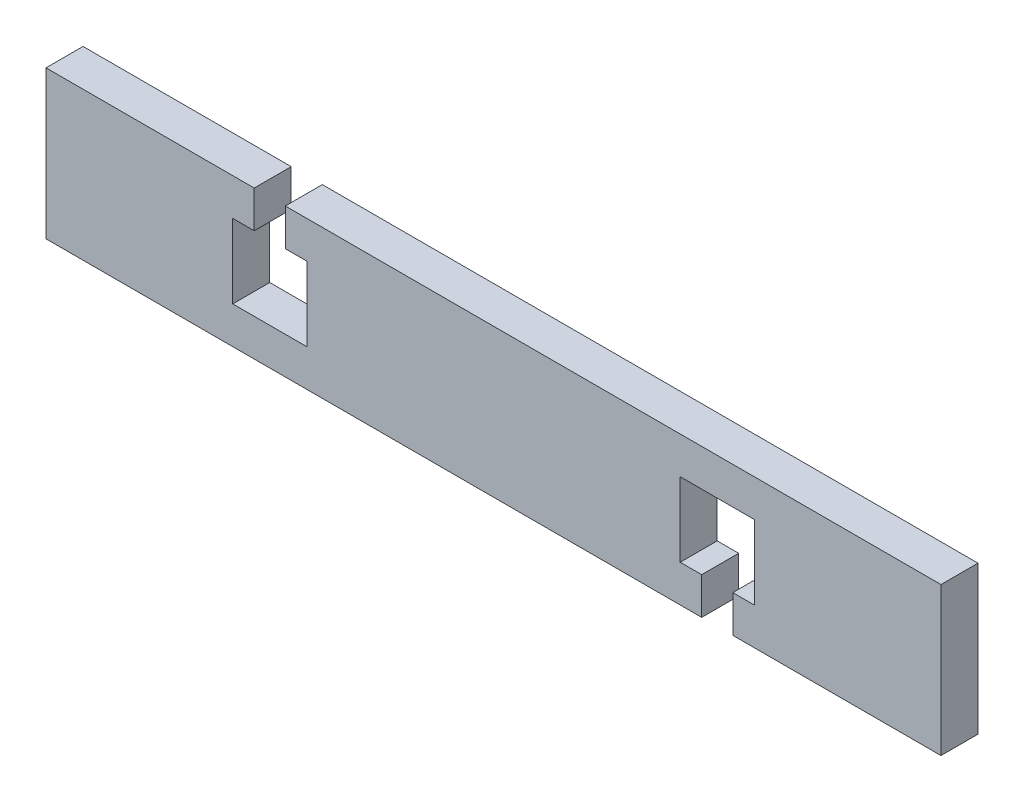
ISO-10303-21;
HEADER;
FILE_DESCRIPTION(('STEP AP214'),'2;1');
FILE_NAME('part.step','',(''),(''),'','','');
FILE_SCHEMA(('AUTOMOTIVE_DESIGN { 1 0 10303 214 1 1 1 1 }'));
ENDSEC;
DATA;
#1=APPLICATION_CONTEXT('core data for automotive mechanical design processes');
#2=APPLICATION_PROTOCOL_DEFINITION('international standard','automotive_design',2000,#1);
#3=PRODUCT_CONTEXT('',#1,'mechanical');
#4=PRODUCT('Part','Part','',(#3));
#5=PRODUCT_RELATED_PRODUCT_CATEGORY('part','',(#4));
#6=PRODUCT_DEFINITION_FORMATION('','',#4);
#7=PRODUCT_DEFINITION_CONTEXT('part definition',#1,'design');
#8=PRODUCT_DEFINITION('design','',#6,#7);
#9=PRODUCT_DEFINITION_SHAPE('','',#8);
#10=(LENGTH_UNIT() NAMED_UNIT(*) SI_UNIT(.MILLI.,.METRE.));
#11=(NAMED_UNIT(*) PLANE_ANGLE_UNIT() SI_UNIT($,.RADIAN.));
#12=(NAMED_UNIT(*) SI_UNIT($,.STERADIAN.) SOLID_ANGLE_UNIT());
#13=UNCERTAINTY_MEASURE_WITH_UNIT(LENGTH_MEASURE(1.E-05),#10,'distance_accuracy_value','');
#14=(GEOMETRIC_REPRESENTATION_CONTEXT(3) GLOBAL_UNCERTAINTY_ASSIGNED_CONTEXT((#13)) GLOBAL_UNIT_ASSIGNED_CONTEXT((#10,
#11,#12)) REPRESENTATION_CONTEXT('',''));
#15=CARTESIAN_POINT('',(0.,0.,0.));
#16=DIRECTION('',(0.,0.,1.));
#17=DIRECTION('',(1.,0.,0.));
#18=AXIS2_PLACEMENT_3D('',#15,#16,#17);
#19=CARTESIAN_POINT('',(-32.3125,10.,5.));
#20=DIRECTION('',(0.,-1.,0.));
#21=DIRECTION('',(1.,0.,0.));
#22=AXIS2_PLACEMENT_3D('',#19,#20,#21);
#23=PLANE('',#22);
#24=DIRECTION('',(-1.,0.,0.));
#25=VECTOR('',#24,1.);
#26=CARTESIAN_POINT('',(-32.3125,10.,0.));
#27=LINE('',#26,#25);
#28=CARTESIAN_POINT('',(-32.3125,10.,0.));
#29=VERTEX_POINT('',#28);
#30=CARTESIAN_POINT('',(-60.425,9.99999999999999,0.));
#31=VERTEX_POINT('',#30);
#32=EDGE_CURVE('E205',#29,#31,#27,.T.);
#33=ORIENTED_EDGE('',*,*,#32,.T.);
#34=DIRECTION('',(0.,0.,-1.));
#35=VECTOR('',#34,1.);
#36=CARTESIAN_POINT('',(-60.425,9.99999999999999,5.));
#37=LINE('',#36,#35);
#38=CARTESIAN_POINT('',(-60.425,9.99999999999999,5.));
#39=VERTEX_POINT('',#38);
#40=EDGE_CURVE('E11',#39,#31,#37,.T.);
#41=ORIENTED_EDGE('',*,*,#40,.F.);
#42=DIRECTION('',(-1.,0.,0.));
#43=VECTOR('',#42,1.);
#44=CARTESIAN_POINT('',(-32.3125,10.,5.));
#45=LINE('',#44,#43);
#46=CARTESIAN_POINT('',(-32.3125,10.,5.));
#47=VERTEX_POINT('',#46);
#48=EDGE_CURVE('E244',#47,#39,#45,.T.);
#49=ORIENTED_EDGE('',*,*,#48,.F.);
#50=DIRECTION('',(0.,0.,-1.));
#51=VECTOR('',#50,1.);
#52=CARTESIAN_POINT('',(-32.3125,10.,5.));
#53=LINE('',#52,#51);
#54=EDGE_CURVE('E201',#47,#29,#53,.T.);
#55=ORIENTED_EDGE('',*,*,#54,.T.);
#56=EDGE_LOOP('',(#33,#41,#49,#55));
#57=FACE_BOUND('',#56,.T.);
#58=ADVANCED_FACE('F37',(#57),#23,.F.);
#59=CARTESIAN_POINT('',(-60.425,-10.,5.));
#60=DIRECTION('',(1.,0.,0.));
#61=DIRECTION('',(0.,0.,-1.));
#62=AXIS2_PLACEMENT_3D('',#59,#60,#61);
#63=PLANE('',#62);
#64=DIRECTION('',(0.,-1.,0.));
#65=VECTOR('',#64,1.);
#66=CARTESIAN_POINT('',(-60.425,-10.,0.));
#67=LINE('',#66,#65);
#68=CARTESIAN_POINT('',(-60.425,-10.,0.));
#69=VERTEX_POINT('',#68);
#70=EDGE_CURVE('E208',#31,#69,#67,.T.);
#71=ORIENTED_EDGE('',*,*,#70,.T.);
#72=DIRECTION('',(0.,0.,-1.));
#73=VECTOR('',#72,1.);
#74=CARTESIAN_POINT('',(-60.425,-10.,5.));
#75=LINE('',#74,#73);
#76=CARTESIAN_POINT('',(-60.425,-10.,5.));
#77=VERTEX_POINT('',#76);
#78=EDGE_CURVE('E45',#77,#69,#75,.T.);
#79=ORIENTED_EDGE('',*,*,#78,.F.);
#80=DIRECTION('',(0.,-1.,0.));
#81=VECTOR('',#80,1.);
#82=CARTESIAN_POINT('',(-60.425,-10.,5.));
#83=LINE('',#82,#81);
#84=EDGE_CURVE('E132',#39,#77,#83,.T.);
#85=ORIENTED_EDGE('',*,*,#84,.F.);
#86=ORIENTED_EDGE('',*,*,#40,.T.);
#87=EDGE_LOOP('',(#71,#79,#85,#86));
#88=FACE_BOUND('',#87,.T.);
#89=ADVANCED_FACE('F361',(#88),#63,.F.);
#90=CARTESIAN_POINT('',(28.1125,-9.99999999999999,5.));
#91=DIRECTION('',(0.,1.,0.));
#92=DIRECTION('',(-1.,0.,0.));
#93=AXIS2_PLACEMENT_3D('',#90,#91,#92);
#94=PLANE('',#93);
#95=DIRECTION('',(1.,0.,0.));
#96=VECTOR('',#95,1.);
#97=CARTESIAN_POINT('',(28.1125,-9.99999999999999,0.));
#98=LINE('',#97,#96);
#99=CARTESIAN_POINT('',(28.1125,-9.99999999999999,0.));
#100=VERTEX_POINT('',#99);
#101=EDGE_CURVE('E210',#69,#100,#98,.T.);
#102=ORIENTED_EDGE('',*,*,#101,.T.);
#103=DIRECTION('',(0.,0.,-1.));
#104=VECTOR('',#103,1.);
#105=CARTESIAN_POINT('',(28.1125,-9.99999999999999,5.));
#106=LINE('',#105,#104);
#107=CARTESIAN_POINT('',(28.1125,-9.99999999999999,5.));
#108=VERTEX_POINT('',#107);
#109=EDGE_CURVE('E287',#108,#100,#106,.T.);
#110=ORIENTED_EDGE('',*,*,#109,.F.);
#111=DIRECTION('',(1.,0.,0.));
#112=VECTOR('',#111,1.);
#113=CARTESIAN_POINT('',(28.1125,-9.99999999999999,5.));
#114=LINE('',#113,#112);
#115=EDGE_CURVE('E295',#77,#108,#114,.T.);
#116=ORIENTED_EDGE('',*,*,#115,.F.);
#117=ORIENTED_EDGE('',*,*,#78,.T.);
#118=EDGE_LOOP('',(#102,#110,#116,#117));
#119=FACE_BOUND('',#118,.T.);
#120=ADVANCED_FACE('F293',(#119),#94,.F.);
#121=CARTESIAN_POINT('',(28.1125,-9.99999999999999,5.));
#122=DIRECTION('',(-1.,0.,0.));
#123=DIRECTION('',(0.,-1.,0.));
#124=AXIS2_PLACEMENT_3D('',#121,#122,#123);
#125=PLANE('',#124);
#126=DIRECTION('',(0.,1.,0.));
#127=VECTOR('',#126,1.);
#128=CARTESIAN_POINT('',(28.1125,-9.99999999999999,0.));
#129=LINE('',#128,#127);
#130=CARTESIAN_POINT('',(28.1125,-4.99999999999999,0.));
#131=VERTEX_POINT('',#130);
#132=EDGE_CURVE('E212',#100,#131,#129,.T.);
#133=ORIENTED_EDGE('',*,*,#132,.T.);
#134=DIRECTION('',(0.,0.,-1.));
#135=VECTOR('',#134,1.);
#136=CARTESIAN_POINT('',(28.1125,-4.99999999999999,5.));
#137=LINE('',#136,#135);
#138=CARTESIAN_POINT('',(28.1125,-4.99999999999999,5.));
#139=VERTEX_POINT('',#138);
#140=EDGE_CURVE('E284',#139,#131,#137,.T.);
#141=ORIENTED_EDGE('',*,*,#140,.F.);
#142=DIRECTION('',(0.,1.,0.));
#143=VECTOR('',#142,1.);
#144=CARTESIAN_POINT('',(28.1125,-9.99999999999999,5.));
#145=LINE('',#144,#143);
#146=EDGE_CURVE('E313',#108,#139,#145,.T.);
#147=ORIENTED_EDGE('',*,*,#146,.F.);
#148=ORIENTED_EDGE('',*,*,#109,.T.);
#149=EDGE_LOOP('',(#133,#141,#147,#148));
#150=FACE_BOUND('',#149,.T.);
#151=ADVANCED_FACE('F304',(#150),#125,.F.);
#152=CARTESIAN_POINT('',(28.1125,-4.99999999999999,5.));
#153=DIRECTION('',(0.,-1.,0.));
#154=DIRECTION('',(0.,0.,-1.));
#155=AXIS2_PLACEMENT_3D('',#152,#153,#154);
#156=PLANE('',#155);
#157=DIRECTION('',(-1.,0.,0.));
#158=VECTOR('',#157,1.);
#159=CARTESIAN_POINT('',(28.1125,-4.99999999999999,0.));
#160=LINE('',#159,#158);
#161=CARTESIAN_POINT('',(25.2125,-4.99999999999999,0.));
#162=VERTEX_POINT('',#161);
#163=EDGE_CURVE('E214',#131,#162,#160,.T.);
#164=ORIENTED_EDGE('',*,*,#163,.T.);
#165=DIRECTION('',(0.,0.,-1.));
#166=VECTOR('',#165,1.);
#167=CARTESIAN_POINT('',(25.2125,-4.99999999999999,5.));
#168=LINE('',#167,#166);
#169=CARTESIAN_POINT('',(25.2125,-4.99999999999999,5.));
#170=VERTEX_POINT('',#169);
#171=EDGE_CURVE('E281',#170,#162,#168,.T.);
#172=ORIENTED_EDGE('',*,*,#171,.F.);
#173=DIRECTION('',(-1.,0.,0.));
#174=VECTOR('',#173,1.);
#175=CARTESIAN_POINT('',(28.1125,-4.99999999999999,5.));
#176=LINE('',#175,#174);
#177=EDGE_CURVE('E310',#139,#170,#176,.T.);
#178=ORIENTED_EDGE('',*,*,#177,.F.);
#179=ORIENTED_EDGE('',*,*,#140,.T.);
#180=EDGE_LOOP('',(#164,#172,#178,#179));
#181=FACE_BOUND('',#180,.T.);
#182=ADVANCED_FACE('F308',(#181),#156,.F.);
#183=CARTESIAN_POINT('',(25.2125,-4.99999999999999,5.));
#184=DIRECTION('',(-1.,0.,0.));
#185=DIRECTION('',(0.,-1.,0.));
#186=AXIS2_PLACEMENT_3D('',#183,#184,#185);
#187=PLANE('',#186);
#188=DIRECTION('',(0.,1.,0.));
#189=VECTOR('',#188,1.);
#190=CARTESIAN_POINT('',(25.2125,-4.99999999999999,0.));
#191=LINE('',#190,#189);
#192=CARTESIAN_POINT('',(25.2125,5.,0.));
#193=VERTEX_POINT('',#192);
#194=EDGE_CURVE('E216',#162,#193,#191,.T.);
#195=ORIENTED_EDGE('',*,*,#194,.T.);
#196=DIRECTION('',(0.,0.,-1.));
#197=VECTOR('',#196,1.);
#198=CARTESIAN_POINT('',(25.2125,5.,5.));
#199=LINE('',#198,#197);
#200=CARTESIAN_POINT('',(25.2125,5.,5.));
#201=VERTEX_POINT('',#200);
#202=EDGE_CURVE('E278',#201,#193,#199,.T.);
#203=ORIENTED_EDGE('',*,*,#202,.F.);
#204=DIRECTION('',(0.,1.,0.));
#205=VECTOR('',#204,1.);
#206=CARTESIAN_POINT('',(25.2125,-4.99999999999999,5.));
#207=LINE('',#206,#205);
#208=EDGE_CURVE('E312',#170,#201,#207,.T.);
#209=ORIENTED_EDGE('',*,*,#208,.F.);
#210=ORIENTED_EDGE('',*,*,#171,.T.);
#211=EDGE_LOOP('',(#195,#203,#209,#210));
#212=FACE_BOUND('',#211,.T.);
#213=ADVANCED_FACE('F374',(#212),#187,.F.);
#214=CARTESIAN_POINT('',(25.2125,5.,5.));
#215=DIRECTION('',(0.,1.,0.));
#216=DIRECTION('',(-1.,0.,0.));
#217=AXIS2_PLACEMENT_3D('',#214,#215,#216);
#218=PLANE('',#217);
#219=DIRECTION('',(1.,0.,0.));
#220=VECTOR('',#219,1.);
#221=CARTESIAN_POINT('',(25.2125,5.,0.));
#222=LINE('',#221,#220);
#223=CARTESIAN_POINT('',(35.2125000000001,5.00000000000001,0.));
#224=VERTEX_POINT('',#223);
#225=EDGE_CURVE('E218',#193,#224,#222,.T.);
#226=ORIENTED_EDGE('',*,*,#225,.T.);
#227=DIRECTION('',(0.,0.,-1.));
#228=VECTOR('',#227,1.);
#229=CARTESIAN_POINT('',(35.2125000000001,5.00000000000001,5.));
#230=LINE('',#229,#228);
#231=CARTESIAN_POINT('',(35.2125000000001,5.00000000000001,5.));
#232=VERTEX_POINT('',#231);
#233=EDGE_CURVE('E275',#232,#224,#230,.T.);
#234=ORIENTED_EDGE('',*,*,#233,.F.);
#235=DIRECTION('',(1.,0.,0.));
#236=VECTOR('',#235,1.);
#237=CARTESIAN_POINT('',(25.2125,5.,5.));
#238=LINE('',#237,#236);
#239=EDGE_CURVE('E315',#201,#232,#238,.T.);
#240=ORIENTED_EDGE('',*,*,#239,.F.);
#241=ORIENTED_EDGE('',*,*,#202,.T.);
#242=EDGE_LOOP('',(#226,#234,#240,#241));
#243=FACE_BOUND('',#242,.T.);
#244=ADVANCED_FACE('F377',(#243),#218,.F.);
#245=CARTESIAN_POINT('',(35.2125000000001,-4.99999999999999,5.));
#246=DIRECTION('',(1.,0.,0.));
#247=DIRECTION('',(0.,0.,-1.));
#248=AXIS2_PLACEMENT_3D('',#245,#246,#247);
#249=PLANE('',#248);
#250=DIRECTION('',(0.,-1.,0.));
#251=VECTOR('',#250,1.);
#252=CARTESIAN_POINT('',(35.2125000000001,-4.99999999999999,0.));
#253=LINE('',#252,#251);
#254=CARTESIAN_POINT('',(35.2125000000001,-4.99999999999999,0.));
#255=VERTEX_POINT('',#254);
#256=EDGE_CURVE('E220',#224,#255,#253,.T.);
#257=ORIENTED_EDGE('',*,*,#256,.T.);
#258=DIRECTION('',(0.,0.,-1.));
#259=VECTOR('',#258,1.);
#260=CARTESIAN_POINT('',(35.2125000000001,-4.99999999999999,5.));
#261=LINE('',#260,#259);
#262=CARTESIAN_POINT('',(35.2125000000001,-4.99999999999999,5.));
#263=VERTEX_POINT('',#262);
#264=EDGE_CURVE('E272',#263,#255,#261,.T.);
#265=ORIENTED_EDGE('',*,*,#264,.F.);
#266=DIRECTION('',(0.,-1.,0.));
#267=VECTOR('',#266,1.);
#268=CARTESIAN_POINT('',(35.2125000000001,-4.99999999999999,5.));
#269=LINE('',#268,#267);
#270=EDGE_CURVE('E321',#232,#263,#269,.T.);
#271=ORIENTED_EDGE('',*,*,#270,.F.);
#272=ORIENTED_EDGE('',*,*,#233,.T.);
#273=EDGE_LOOP('',(#257,#265,#271,#272));
#274=FACE_BOUND('',#273,.T.);
#275=ADVANCED_FACE('F381',(#274),#249,.F.);
#276=CARTESIAN_POINT('',(32.3125000000001,-4.99999999999999,5.));
#277=DIRECTION('',(0.,-1.,0.));
#278=DIRECTION('',(1.,0.,0.));
#279=AXIS2_PLACEMENT_3D('',#276,#277,#278);
#280=PLANE('',#279);
#281=DIRECTION('',(-1.,0.,0.));
#282=VECTOR('',#281,1.);
#283=CARTESIAN_POINT('',(32.3125000000001,-4.99999999999999,0.));
#284=LINE('',#283,#282);
#285=CARTESIAN_POINT('',(32.3125000000001,-4.99999999999999,0.));
#286=VERTEX_POINT('',#285);
#287=EDGE_CURVE('E222',#255,#286,#284,.T.);
#288=ORIENTED_EDGE('',*,*,#287,.T.);
#289=DIRECTION('',(0.,0.,-1.));
#290=VECTOR('',#289,1.);
#291=CARTESIAN_POINT('',(32.3125000000001,-4.99999999999999,5.));
#292=LINE('',#291,#290);
#293=CARTESIAN_POINT('',(32.3125000000001,-4.99999999999999,5.));
#294=VERTEX_POINT('',#293);
#295=EDGE_CURVE('E269',#294,#286,#292,.T.);
#296=ORIENTED_EDGE('',*,*,#295,.F.);
#297=DIRECTION('',(-1.,0.,0.));
#298=VECTOR('',#297,1.);
#299=CARTESIAN_POINT('',(32.3125000000001,-4.99999999999999,5.));
#300=LINE('',#299,#298);
#301=EDGE_CURVE('E323',#263,#294,#300,.T.);
#302=ORIENTED_EDGE('',*,*,#301,.F.);
#303=ORIENTED_EDGE('',*,*,#264,.T.);
#304=EDGE_LOOP('',(#288,#296,#302,#303));
#305=FACE_BOUND('',#304,.T.);
#306=ADVANCED_FACE('F385',(#305),#280,.F.);
#307=CARTESIAN_POINT('',(32.3125000000001,-9.99999999999999,5.));
#308=DIRECTION('',(1.,0.,0.));
#309=DIRECTION('',(0.,1.,0.));
#310=AXIS2_PLACEMENT_3D('',#307,#308,#309);
#311=PLANE('',#310);
#312=DIRECTION('',(0.,-1.,0.));
#313=VECTOR('',#312,1.);
#314=CARTESIAN_POINT('',(32.3125000000001,-9.99999999999999,0.));
#315=LINE('',#314,#313);
#316=CARTESIAN_POINT('',(32.3125000000001,-9.99999999999999,0.));
#317=VERTEX_POINT('',#316);
#318=EDGE_CURVE('E224',#286,#317,#315,.T.);
#319=ORIENTED_EDGE('',*,*,#318,.T.);
#320=DIRECTION('',(0.,0.,-1.));
#321=VECTOR('',#320,1.);
#322=CARTESIAN_POINT('',(32.3125000000001,-9.99999999999999,5.));
#323=LINE('',#322,#321);
#324=CARTESIAN_POINT('',(32.3125000000001,-9.99999999999999,5.));
#325=VERTEX_POINT('',#324);
#326=EDGE_CURVE('E266',#325,#317,#323,.T.);
#327=ORIENTED_EDGE('',*,*,#326,.F.);
#328=DIRECTION('',(0.,-1.,0.));
#329=VECTOR('',#328,1.);
#330=CARTESIAN_POINT('',(32.3125000000001,-9.99999999999999,5.));
#331=LINE('',#330,#329);
#332=EDGE_CURVE('E325',#294,#325,#331,.T.);
#333=ORIENTED_EDGE('',*,*,#332,.F.);
#334=ORIENTED_EDGE('',*,*,#295,.T.);
#335=EDGE_LOOP('',(#319,#327,#333,#334));
#336=FACE_BOUND('',#335,.T.);
#337=ADVANCED_FACE('F389',(#336),#311,.F.);
#338=CARTESIAN_POINT('',(60.425,-9.99999999999999,5.));
#339=DIRECTION('',(0.,1.,0.));
#340=DIRECTION('',(0.,0.,1.));
#341=AXIS2_PLACEMENT_3D('',#338,#339,#340);
#342=PLANE('',#341);
#343=DIRECTION('',(1.,0.,0.));
#344=VECTOR('',#343,1.);
#345=CARTESIAN_POINT('',(60.425,-9.99999999999999,0.));
#346=LINE('',#345,#344);
#347=CARTESIAN_POINT('',(60.425,-9.99999999999999,0.));
#348=VERTEX_POINT('',#347);
#349=EDGE_CURVE('E226',#317,#348,#346,.T.);
#350=ORIENTED_EDGE('',*,*,#349,.T.);
#351=DIRECTION('',(0.,0.,-1.));
#352=VECTOR('',#351,1.);
#353=CARTESIAN_POINT('',(60.425,-9.99999999999999,5.));
#354=LINE('',#353,#352);
#355=CARTESIAN_POINT('',(60.425,-9.99999999999999,5.));
#356=VERTEX_POINT('',#355);
#357=EDGE_CURVE('E263',#356,#348,#354,.T.);
#358=ORIENTED_EDGE('',*,*,#357,.F.);
#359=DIRECTION('',(1.,0.,0.));
#360=VECTOR('',#359,1.);
#361=CARTESIAN_POINT('',(60.425,-9.99999999999999,5.));
#362=LINE('',#361,#360);
#363=EDGE_CURVE('E327',#325,#356,#362,.T.);
#364=ORIENTED_EDGE('',*,*,#363,.F.);
#365=ORIENTED_EDGE('',*,*,#326,.T.);
#366=EDGE_LOOP('',(#350,#358,#364,#365));
#367=FACE_BOUND('',#366,.T.);
#368=ADVANCED_FACE('F393',(#367),#342,.F.);
#369=CARTESIAN_POINT('',(60.425,-9.99999999999999,5.));
#370=DIRECTION('',(-1.,0.,0.));
#371=DIRECTION('',(0.,0.,1.));
#372=AXIS2_PLACEMENT_3D('',#369,#370,#371);
#373=PLANE('',#372);
#374=DIRECTION('',(0.,1.,0.));
#375=VECTOR('',#374,1.);
#376=CARTESIAN_POINT('',(60.425,-9.99999999999999,0.));
#377=LINE('',#376,#375);
#378=CARTESIAN_POINT('',(60.425,10.,0.));
#379=VERTEX_POINT('',#378);
#380=EDGE_CURVE('E228',#348,#379,#377,.T.);
#381=ORIENTED_EDGE('',*,*,#380,.T.);
#382=DIRECTION('',(0.,0.,-1.));
#383=VECTOR('',#382,1.);
#384=CARTESIAN_POINT('',(60.425,10.,5.));
#385=LINE('',#384,#383);
#386=CARTESIAN_POINT('',(60.425,10.,5.));
#387=VERTEX_POINT('',#386);
#388=EDGE_CURVE('E260',#387,#379,#385,.T.);
#389=ORIENTED_EDGE('',*,*,#388,.F.);
#390=DIRECTION('',(0.,1.,0.));
#391=VECTOR('',#390,1.);
#392=CARTESIAN_POINT('',(60.425,-9.99999999999999,5.));
#393=LINE('',#392,#391);
#394=EDGE_CURVE('E329',#356,#387,#393,.T.);
#395=ORIENTED_EDGE('',*,*,#394,.F.);
#396=ORIENTED_EDGE('',*,*,#357,.T.);
#397=EDGE_LOOP('',(#381,#389,#395,#396));
#398=FACE_BOUND('',#397,.T.);
#399=ADVANCED_FACE('F397',(#398),#373,.F.);
#400=CARTESIAN_POINT('',(60.425,10.,5.));
#401=DIRECTION('',(0.,-1.,0.));
#402=DIRECTION('',(1.,0.,0.));
#403=AXIS2_PLACEMENT_3D('',#400,#401,#402);
#404=PLANE('',#403);
#405=DIRECTION('',(-1.,0.,0.));
#406=VECTOR('',#405,1.);
#407=CARTESIAN_POINT('',(60.425,10.,0.));
#408=LINE('',#407,#406);
#409=CARTESIAN_POINT('',(-28.1125,9.99999999999997,0.));
#410=VERTEX_POINT('',#409);
#411=EDGE_CURVE('E230',#379,#410,#408,.T.);
#412=ORIENTED_EDGE('',*,*,#411,.T.);
#413=DIRECTION('',(0.,0.,-1.));
#414=VECTOR('',#413,1.);
#415=CARTESIAN_POINT('',(-28.1125,9.99999999999997,5.));
#416=LINE('',#415,#414);
#417=CARTESIAN_POINT('',(-28.1125,9.99999999999997,5.));
#418=VERTEX_POINT('',#417);
#419=EDGE_CURVE('E257',#418,#410,#416,.T.);
#420=ORIENTED_EDGE('',*,*,#419,.F.);
#421=DIRECTION('',(-1.,0.,0.));
#422=VECTOR('',#421,1.);
#423=CARTESIAN_POINT('',(60.425,10.,5.));
#424=LINE('',#423,#422);
#425=EDGE_CURVE('E331',#387,#418,#424,.T.);
#426=ORIENTED_EDGE('',*,*,#425,.F.);
#427=ORIENTED_EDGE('',*,*,#388,.T.);
#428=EDGE_LOOP('',(#412,#420,#426,#427));
#429=FACE_BOUND('',#428,.T.);
#430=ADVANCED_FACE('F401',(#429),#404,.F.);
#431=CARTESIAN_POINT('',(-28.1125,9.99999999999997,5.));
#432=DIRECTION('',(1.,0.,0.));
#433=DIRECTION('',(0.,1.,0.));
#434=AXIS2_PLACEMENT_3D('',#431,#432,#433);
#435=PLANE('',#434);
#436=DIRECTION('',(0.,-1.,0.));
#437=VECTOR('',#436,1.);
#438=CARTESIAN_POINT('',(-28.1125,9.99999999999997,0.));
#439=LINE('',#438,#437);
#440=CARTESIAN_POINT('',(-28.1125,4.99999999999997,0.));
#441=VERTEX_POINT('',#440);
#442=EDGE_CURVE('E232',#410,#441,#439,.T.);
#443=ORIENTED_EDGE('',*,*,#442,.T.);
#444=DIRECTION('',(0.,0.,-1.));
#445=VECTOR('',#444,1.);
#446=CARTESIAN_POINT('',(-28.1125,4.99999999999997,5.));
#447=LINE('',#446,#445);
#448=CARTESIAN_POINT('',(-28.1125,4.99999999999997,5.));
#449=VERTEX_POINT('',#448);
#450=EDGE_CURVE('E254',#449,#441,#447,.T.);
#451=ORIENTED_EDGE('',*,*,#450,.F.);
#452=DIRECTION('',(0.,-1.,0.));
#453=VECTOR('',#452,1.);
#454=CARTESIAN_POINT('',(-28.1125,9.99999999999997,5.));
#455=LINE('',#454,#453);
#456=EDGE_CURVE('E333',#418,#449,#455,.T.);
#457=ORIENTED_EDGE('',*,*,#456,.F.);
#458=ORIENTED_EDGE('',*,*,#419,.T.);
#459=EDGE_LOOP('',(#443,#451,#457,#458));
#460=FACE_BOUND('',#459,.T.);
#461=ADVANCED_FACE('F405',(#460),#435,.F.);
#462=CARTESIAN_POINT('',(-28.1125,4.99999999999997,5.));
#463=DIRECTION('',(0.,1.,0.));
#464=DIRECTION('',(-1.,0.,0.));
#465=AXIS2_PLACEMENT_3D('',#462,#463,#464);
#466=PLANE('',#465);
#467=DIRECTION('',(1.,0.,0.));
#468=VECTOR('',#467,1.);
#469=CARTESIAN_POINT('',(-28.1125,4.99999999999997,0.));
#470=LINE('',#469,#468);
#471=CARTESIAN_POINT('',(-25.2125,4.99999999999994,0.));
#472=VERTEX_POINT('',#471);
#473=EDGE_CURVE('E234',#441,#472,#470,.T.);
#474=ORIENTED_EDGE('',*,*,#473,.T.);
#475=DIRECTION('',(0.,0.,-1.));
#476=VECTOR('',#475,1.);
#477=CARTESIAN_POINT('',(-25.2125,4.99999999999994,5.));
#478=LINE('',#477,#476);
#479=CARTESIAN_POINT('',(-25.2125,4.99999999999994,5.));
#480=VERTEX_POINT('',#479);
#481=EDGE_CURVE('E251',#480,#472,#478,.T.);
#482=ORIENTED_EDGE('',*,*,#481,.F.);
#483=DIRECTION('',(1.,0.,0.));
#484=VECTOR('',#483,1.);
#485=CARTESIAN_POINT('',(-28.1125,4.99999999999997,5.));
#486=LINE('',#485,#484);
#487=EDGE_CURVE('E335',#449,#480,#486,.T.);
#488=ORIENTED_EDGE('',*,*,#487,.F.);
#489=ORIENTED_EDGE('',*,*,#450,.T.);
#490=EDGE_LOOP('',(#474,#482,#488,#489));
#491=FACE_BOUND('',#490,.T.);
#492=ADVANCED_FACE('F409',(#491),#466,.F.);
#493=CARTESIAN_POINT('',(-25.2125,4.99999999999994,5.));
#494=DIRECTION('',(1.,0.,0.));
#495=DIRECTION('',(0.,1.,0.));
#496=AXIS2_PLACEMENT_3D('',#493,#494,#495);
#497=PLANE('',#496);
#498=DIRECTION('',(0.,-1.,0.));
#499=VECTOR('',#498,1.);
#500=CARTESIAN_POINT('',(-25.2125,4.99999999999994,0.));
#501=LINE('',#500,#499);
#502=CARTESIAN_POINT('',(-25.2125000000001,-5.00000000000006,0.));
#503=VERTEX_POINT('',#502);
#504=EDGE_CURVE('E236',#472,#503,#501,.T.);
#505=ORIENTED_EDGE('',*,*,#504,.T.);
#506=DIRECTION('',(0.,0.,-1.));
#507=VECTOR('',#506,1.);
#508=CARTESIAN_POINT('',(-25.2125000000001,-5.00000000000006,5.));
#509=LINE('',#508,#507);
#510=CARTESIAN_POINT('',(-25.2125000000001,-5.00000000000006,5.));
#511=VERTEX_POINT('',#510);
#512=EDGE_CURVE('E248',#511,#503,#509,.T.);
#513=ORIENTED_EDGE('',*,*,#512,.F.);
#514=DIRECTION('',(0.,-1.,0.));
#515=VECTOR('',#514,1.);
#516=CARTESIAN_POINT('',(-25.2125,4.99999999999994,5.));
#517=LINE('',#516,#515);
#518=EDGE_CURVE('E337',#480,#511,#517,.T.);
#519=ORIENTED_EDGE('',*,*,#518,.F.);
#520=ORIENTED_EDGE('',*,*,#481,.T.);
#521=EDGE_LOOP('',(#505,#513,#519,#520));
#522=FACE_BOUND('',#521,.T.);
#523=ADVANCED_FACE('F343',(#522),#497,.F.);
#524=CARTESIAN_POINT('',(-35.2125,-5.,5.));
#525=DIRECTION('',(0.,-1.,0.));
#526=DIRECTION('',(1.,0.,0.));
#527=AXIS2_PLACEMENT_3D('',#524,#525,#526);
#528=PLANE('',#527);
#529=DIRECTION('',(-1.,0.,0.));
#530=VECTOR('',#529,1.);
#531=CARTESIAN_POINT('',(-35.2125,-5.,0.));
#532=LINE('',#531,#530);
#533=CARTESIAN_POINT('',(-35.2125,-5.,0.));
#534=VERTEX_POINT('',#533);
#535=EDGE_CURVE('E239',#503,#534,#532,.T.);
#536=ORIENTED_EDGE('',*,*,#535,.T.);
#537=DIRECTION('',(0.,0.,-1.));
#538=VECTOR('',#537,1.);
#539=CARTESIAN_POINT('',(-35.2125,-5.,5.));
#540=LINE('',#539,#538);
#541=CARTESIAN_POINT('',(-35.2125,-5.,5.));
#542=VERTEX_POINT('',#541);
#543=EDGE_CURVE('E196',#542,#534,#540,.T.);
#544=ORIENTED_EDGE('',*,*,#543,.F.);
#545=DIRECTION('',(-1.,0.,0.));
#546=VECTOR('',#545,1.);
#547=CARTESIAN_POINT('',(-25.2125000000001,-5.00000000000006,5.));
#548=LINE('',#547,#546);
#549=EDGE_CURVE('E187',#511,#542,#548,.T.);
#550=ORIENTED_EDGE('',*,*,#549,.F.);
#551=ORIENTED_EDGE('',*,*,#512,.T.);
#552=EDGE_LOOP('',(#536,#544,#550,#551));
#553=FACE_BOUND('',#552,.T.);
#554=ADVANCED_FACE('F346',(#553),#528,.F.);
#555=CARTESIAN_POINT('',(-35.2125,5.,5.));
#556=DIRECTION('',(-1.,0.,0.));
#557=DIRECTION('',(0.,0.,1.));
#558=AXIS2_PLACEMENT_3D('',#555,#556,#557);
#559=PLANE('',#558);
#560=DIRECTION('',(0.,1.,0.));
#561=VECTOR('',#560,1.);
#562=CARTESIAN_POINT('',(-35.2125,5.,0.));
#563=LINE('',#562,#561);
#564=CARTESIAN_POINT('',(-35.2125,5.,0.));
#565=VERTEX_POINT('',#564);
#566=EDGE_CURVE('E195',#534,#565,#563,.T.);
#567=ORIENTED_EDGE('',*,*,#566,.T.);
#568=DIRECTION('',(0.,0.,-1.));
#569=VECTOR('',#568,1.);
#570=CARTESIAN_POINT('',(-35.2125,5.,5.));
#571=LINE('',#570,#569);
#572=CARTESIAN_POINT('',(-35.2125,5.,5.));
#573=VERTEX_POINT('',#572);
#574=EDGE_CURVE('E192',#573,#565,#571,.T.);
#575=ORIENTED_EDGE('',*,*,#574,.F.);
#576=DIRECTION('',(0.,1.,0.));
#577=VECTOR('',#576,1.);
#578=CARTESIAN_POINT('',(-35.2125,5.,5.));
#579=LINE('',#578,#577);
#580=EDGE_CURVE('E181',#542,#573,#579,.T.);
#581=ORIENTED_EDGE('',*,*,#580,.F.);
#582=ORIENTED_EDGE('',*,*,#543,.T.);
#583=EDGE_LOOP('',(#567,#575,#581,#582));
#584=FACE_BOUND('',#583,.T.);
#585=ADVANCED_FACE('F193',(#584),#559,.F.);
#586=CARTESIAN_POINT('',(-32.3125,5.,5.));
#587=DIRECTION('',(0.,1.,0.));
#588=DIRECTION('',(0.,0.,1.));
#589=AXIS2_PLACEMENT_3D('',#586,#587,#588);
#590=PLANE('',#589);
#591=DIRECTION('',(1.,0.,0.));
#592=VECTOR('',#591,1.);
#593=CARTESIAN_POINT('',(-32.3125,5.,0.));
#594=LINE('',#593,#592);
#595=CARTESIAN_POINT('',(-32.3125,5.,0.));
#596=VERTEX_POINT('',#595);
#597=EDGE_CURVE('E118',#565,#596,#594,.T.);
#598=ORIENTED_EDGE('',*,*,#597,.T.);
#599=DIRECTION('',(0.,0.,-1.));
#600=VECTOR('',#599,1.);
#601=CARTESIAN_POINT('',(-32.3125,5.,5.));
#602=LINE('',#601,#600);
#603=CARTESIAN_POINT('',(-32.3125,5.,5.));
#604=VERTEX_POINT('',#603);
#605=EDGE_CURVE('E197',#604,#596,#602,.T.);
#606=ORIENTED_EDGE('',*,*,#605,.F.);
#607=DIRECTION('',(1.,0.,0.));
#608=VECTOR('',#607,1.);
#609=CARTESIAN_POINT('',(-32.3125,5.,5.));
#610=LINE('',#609,#608);
#611=EDGE_CURVE('E185',#573,#604,#610,.T.);
#612=ORIENTED_EDGE('',*,*,#611,.F.);
#613=ORIENTED_EDGE('',*,*,#574,.T.);
#614=EDGE_LOOP('',(#598,#606,#612,#613));
#615=FACE_BOUND('',#614,.T.);
#616=ADVANCED_FACE('F199',(#615),#590,.F.);
#617=CARTESIAN_POINT('',(-32.3125,10.,5.));
#618=DIRECTION('',(-1.,0.,0.));
#619=DIRECTION('',(0.,0.,1.));
#620=AXIS2_PLACEMENT_3D('',#617,#618,#619);
#621=PLANE('',#620);
#622=DIRECTION('',(0.,1.,0.));
#623=VECTOR('',#622,1.);
#624=CARTESIAN_POINT('',(-32.3125,10.,0.));
#625=LINE('',#624,#623);
#626=EDGE_CURVE('E124',#596,#29,#625,.T.);
#627=ORIENTED_EDGE('',*,*,#626,.T.);
#628=ORIENTED_EDGE('',*,*,#54,.F.);
#629=DIRECTION('',(0.,1.,0.));
#630=VECTOR('',#629,1.);
#631=CARTESIAN_POINT('',(-32.3125,10.,5.));
#632=LINE('',#631,#630);
#633=EDGE_CURVE('E53',#604,#47,#632,.T.);
#634=ORIENTED_EDGE('',*,*,#633,.F.);
#635=ORIENTED_EDGE('',*,*,#605,.T.);
#636=EDGE_LOOP('',(#627,#628,#634,#635));
#637=FACE_BOUND('',#636,.T.);
#638=ADVANCED_FACE('F350',(#637),#621,.F.);
#639=CARTESIAN_POINT('',(0.,0.,5.));
#640=DIRECTION('',(0.,0.,-1.));
#641=DIRECTION('',(-1.,0.,0.));
#642=AXIS2_PLACEMENT_3D('',#639,#640,#641);
#643=PLANE('',#642);
#644=ORIENTED_EDGE('',*,*,#48,.T.);
#645=ORIENTED_EDGE('',*,*,#84,.T.);
#646=ORIENTED_EDGE('',*,*,#115,.T.);
#647=ORIENTED_EDGE('',*,*,#146,.T.);
#648=ORIENTED_EDGE('',*,*,#177,.T.);
#649=ORIENTED_EDGE('',*,*,#208,.T.);
#650=ORIENTED_EDGE('',*,*,#239,.T.);
#651=ORIENTED_EDGE('',*,*,#270,.T.);
#652=ORIENTED_EDGE('',*,*,#301,.T.);
#653=ORIENTED_EDGE('',*,*,#332,.T.);
#654=ORIENTED_EDGE('',*,*,#363,.T.);
#655=ORIENTED_EDGE('',*,*,#394,.T.);
#656=ORIENTED_EDGE('',*,*,#425,.T.);
#657=ORIENTED_EDGE('',*,*,#456,.T.);
#658=ORIENTED_EDGE('',*,*,#487,.T.);
#659=ORIENTED_EDGE('',*,*,#518,.T.);
#660=ORIENTED_EDGE('',*,*,#549,.T.);
#661=ORIENTED_EDGE('',*,*,#580,.T.);
#662=ORIENTED_EDGE('',*,*,#611,.T.);
#663=ORIENTED_EDGE('',*,*,#633,.T.);
#664=EDGE_LOOP('',(#644,#645,#646,#647,#648,#649,#650,#651,#652,#653,#654,#655,#656,#657,#658,
#659,#660,#661,#662,#663));
#665=FACE_BOUND('',#664,.T.);
#666=ADVANCED_FACE('F183',(#665),#643,.F.);
#667=CARTESIAN_POINT('',(0.,0.,0.));
#668=DIRECTION('',(0.,0.,-1.));
#669=DIRECTION('',(-1.,0.,0.));
#670=AXIS2_PLACEMENT_3D('',#667,#668,#669);
#671=PLANE('',#670);
#672=ORIENTED_EDGE('',*,*,#32,.F.);
#673=ORIENTED_EDGE('',*,*,#626,.F.);
#674=ORIENTED_EDGE('',*,*,#597,.F.);
#675=ORIENTED_EDGE('',*,*,#566,.F.);
#676=ORIENTED_EDGE('',*,*,#535,.F.);
#677=ORIENTED_EDGE('',*,*,#504,.F.);
#678=ORIENTED_EDGE('',*,*,#473,.F.);
#679=ORIENTED_EDGE('',*,*,#442,.F.);
#680=ORIENTED_EDGE('',*,*,#411,.F.);
#681=ORIENTED_EDGE('',*,*,#380,.F.);
#682=ORIENTED_EDGE('',*,*,#349,.F.);
#683=ORIENTED_EDGE('',*,*,#318,.F.);
#684=ORIENTED_EDGE('',*,*,#287,.F.);
#685=ORIENTED_EDGE('',*,*,#256,.F.);
#686=ORIENTED_EDGE('',*,*,#225,.F.);
#687=ORIENTED_EDGE('',*,*,#194,.F.);
#688=ORIENTED_EDGE('',*,*,#163,.F.);
#689=ORIENTED_EDGE('',*,*,#132,.F.);
#690=ORIENTED_EDGE('',*,*,#101,.F.);
#691=ORIENTED_EDGE('',*,*,#70,.F.);
#692=EDGE_LOOP('',(#672,#673,#674,#675,#676,#677,#678,#679,#680,#681,#682,#683,#684,#685,#686,
#687,#688,#689,#690,#691));
#693=FACE_BOUND('',#692,.T.);
#694=ADVANCED_FACE('F299',(#693),#671,.T.);
#695=CLOSED_SHELL('',(#58,#89,#120,#151,#182,#213,#244,#275,#306,#337,#368,#399,#430,#461,#492,
#523,#554,#585,#616,#638,#666,#694));
#696=MANIFOLD_SOLID_BREP('B2',#695);
#697=ADVANCED_BREP_SHAPE_REPRESENTATION('',(#18,#696),#14);
#698=SHAPE_DEFINITION_REPRESENTATION(#9,#697);
ENDSEC;
END-ISO-10303-21;
